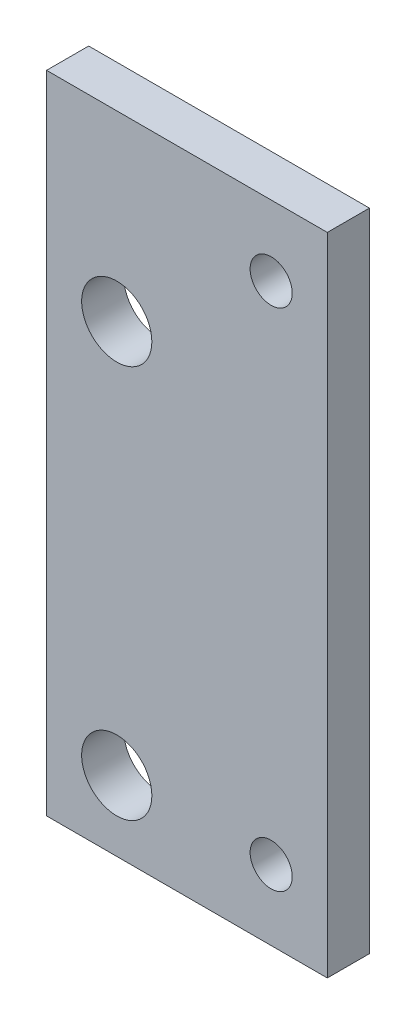
ISO-10303-21;
HEADER;
FILE_DESCRIPTION(('STEP AP214'),'2;1');
FILE_NAME('part.step','',(''),(''),'','','');
FILE_SCHEMA(('AUTOMOTIVE_DESIGN { 1 0 10303 214 1 1 1 1 }'));
ENDSEC;
DATA;
#1=APPLICATION_CONTEXT('core data for automotive mechanical design processes');
#2=APPLICATION_PROTOCOL_DEFINITION('international standard','automotive_design',2000,#1);
#3=PRODUCT_CONTEXT('',#1,'mechanical');
#4=PRODUCT('Part','Part','',(#3));
#5=PRODUCT_RELATED_PRODUCT_CATEGORY('part','',(#4));
#6=PRODUCT_DEFINITION_FORMATION('','',#4);
#7=PRODUCT_DEFINITION_CONTEXT('part definition',#1,'design');
#8=PRODUCT_DEFINITION('design','',#6,#7);
#9=PRODUCT_DEFINITION_SHAPE('','',#8);
#10=(LENGTH_UNIT() NAMED_UNIT(*) SI_UNIT(.MILLI.,.METRE.));
#11=(NAMED_UNIT(*) PLANE_ANGLE_UNIT() SI_UNIT($,.RADIAN.));
#12=(NAMED_UNIT(*) SI_UNIT($,.STERADIAN.) SOLID_ANGLE_UNIT());
#13=UNCERTAINTY_MEASURE_WITH_UNIT(LENGTH_MEASURE(1.E-05),#10,'distance_accuracy_value','');
#14=(GEOMETRIC_REPRESENTATION_CONTEXT(3) GLOBAL_UNCERTAINTY_ASSIGNED_CONTEXT((#13)) GLOBAL_UNIT_ASSIGNED_CONTEXT((#10,
#11,#12)) REPRESENTATION_CONTEXT('',''));
#15=CARTESIAN_POINT('',(0.,0.,0.));
#16=DIRECTION('',(0.,0.,1.));
#17=DIRECTION('',(1.,0.,0.));
#18=AXIS2_PLACEMENT_3D('',#15,#16,#17);
#19=CARTESIAN_POINT('',(0.,46.,3.));
#20=DIRECTION('',(0.,0.,-1.));
#21=DIRECTION('',(-1.,0.,0.));
#22=AXIS2_PLACEMENT_3D('',#19,#20,#21);
#23=PLANE('',#22);
#24=CARTESIAN_POINT('',(16.,41.,3.));
#25=DIRECTION('',(0.,0.,1.));
#26=DIRECTION('',(1.,0.,0.));
#27=AXIS2_PLACEMENT_3D('',#24,#25,#26);
#28=CIRCLE('',#27,1.5);
#29=CARTESIAN_POINT('',(17.5,41.,3.));
#30=VERTEX_POINT('',#29);
#31=EDGE_CURVE('E118',#30,#30,#28,.T.);
#32=ORIENTED_EDGE('',*,*,#31,.F.);
#33=EDGE_LOOP('',(#32));
#34=FACE_BOUND('',#33,.T.);
#35=CARTESIAN_POINT('',(5.,33.,3.));
#36=DIRECTION('',(0.,0.,1.));
#37=DIRECTION('',(1.,0.,0.));
#38=AXIS2_PLACEMENT_3D('',#35,#36,#37);
#39=CIRCLE('',#38,2.5);
#40=CARTESIAN_POINT('',(7.5,33.,3.));
#41=VERTEX_POINT('',#40);
#42=EDGE_CURVE('E97',#41,#41,#39,.T.);
#43=ORIENTED_EDGE('',*,*,#42,.F.);
#44=EDGE_LOOP('',(#43));
#45=FACE_BOUND('',#44,.T.);
#46=DIRECTION('',(0.,-1.,0.));
#47=VECTOR('',#46,1.);
#48=CARTESIAN_POINT('',(0.,0.,3.));
#49=LINE('',#48,#47);
#50=CARTESIAN_POINT('',(0.,46.,3.));
#51=VERTEX_POINT('',#50);
#52=CARTESIAN_POINT('',(0.,0.,3.));
#53=VERTEX_POINT('',#52);
#54=EDGE_CURVE('E82',#51,#53,#49,.T.);
#55=ORIENTED_EDGE('',*,*,#54,.T.);
#56=DIRECTION('',(1.,0.,0.));
#57=VECTOR('',#56,1.);
#58=CARTESIAN_POINT('',(0.,0.,3.));
#59=LINE('',#58,#57);
#60=CARTESIAN_POINT('',(20.,0.,3.));
#61=VERTEX_POINT('',#60);
#62=EDGE_CURVE('E77',#53,#61,#59,.T.);
#63=ORIENTED_EDGE('',*,*,#62,.T.);
#64=DIRECTION('',(0.,1.,0.));
#65=VECTOR('',#64,1.);
#66=CARTESIAN_POINT('',(20.,0.,3.));
#67=LINE('',#66,#65);
#68=CARTESIAN_POINT('',(20.,46.,3.));
#69=VERTEX_POINT('',#68);
#70=EDGE_CURVE('E80',#61,#69,#67,.T.);
#71=ORIENTED_EDGE('',*,*,#70,.T.);
#72=DIRECTION('',(-1.,0.,0.));
#73=VECTOR('',#72,1.);
#74=CARTESIAN_POINT('',(0.,46.,3.));
#75=LINE('',#74,#73);
#76=EDGE_CURVE('E47',#69,#51,#75,.T.);
#77=ORIENTED_EDGE('',*,*,#76,.T.);
#78=EDGE_LOOP('',(#55,#63,#71,#77));
#79=FACE_BOUND('',#78,.T.);
#80=CARTESIAN_POINT('',(5.00000000000001,5.,3.));
#81=DIRECTION('',(0.,0.,1.));
#82=DIRECTION('',(1.,0.,0.));
#83=AXIS2_PLACEMENT_3D('',#80,#81,#82);
#84=CIRCLE('',#83,2.5);
#85=CARTESIAN_POINT('',(7.50000000000001,5.,3.));
#86=VERTEX_POINT('',#85);
#87=EDGE_CURVE('E112',#86,#86,#84,.T.);
#88=ORIENTED_EDGE('',*,*,#87,.F.);
#89=EDGE_LOOP('',(#88));
#90=FACE_BOUND('',#89,.T.);
#91=CARTESIAN_POINT('',(16.,5.,3.));
#92=DIRECTION('',(0.,0.,1.));
#93=DIRECTION('',(-1.,0.,0.));
#94=AXIS2_PLACEMENT_3D('',#91,#92,#93);
#95=CIRCLE('',#94,1.5);
#96=CARTESIAN_POINT('',(14.5,5.,3.));
#97=VERTEX_POINT('',#96);
#98=EDGE_CURVE('E124',#97,#97,#95,.T.);
#99=ORIENTED_EDGE('',*,*,#98,.F.);
#100=EDGE_LOOP('',(#99));
#101=FACE_BOUND('',#100,.T.);
#102=ADVANCED_FACE('F30',(#34,#45,#79,#90,#101),#23,.F.);
#103=CARTESIAN_POINT('',(0.,46.,0.));
#104=DIRECTION('',(0.,0.,-1.));
#105=DIRECTION('',(-1.,0.,0.));
#106=AXIS2_PLACEMENT_3D('',#103,#104,#105);
#107=PLANE('',#106);
#108=CARTESIAN_POINT('',(16.,41.,0.));
#109=DIRECTION('',(0.,0.,1.));
#110=DIRECTION('',(1.,0.,0.));
#111=AXIS2_PLACEMENT_3D('',#108,#109,#110);
#112=CIRCLE('',#111,1.5);
#113=CARTESIAN_POINT('',(17.5,41.,0.));
#114=VERTEX_POINT('',#113);
#115=EDGE_CURVE('E121',#114,#114,#112,.T.);
#116=ORIENTED_EDGE('',*,*,#115,.T.);
#117=EDGE_LOOP('',(#116));
#118=FACE_BOUND('',#117,.T.);
#119=CARTESIAN_POINT('',(5.,33.,0.));
#120=DIRECTION('',(0.,0.,1.));
#121=DIRECTION('',(1.,0.,0.));
#122=AXIS2_PLACEMENT_3D('',#119,#120,#121);
#123=CIRCLE('',#122,2.5);
#124=CARTESIAN_POINT('',(7.5,33.,0.));
#125=VERTEX_POINT('',#124);
#126=EDGE_CURVE('E109',#125,#125,#123,.T.);
#127=ORIENTED_EDGE('',*,*,#126,.T.);
#128=EDGE_LOOP('',(#127));
#129=FACE_BOUND('',#128,.T.);
#130=DIRECTION('',(0.,-1.,0.));
#131=VECTOR('',#130,1.);
#132=CARTESIAN_POINT('',(0.,0.,0.));
#133=LINE('',#132,#131);
#134=CARTESIAN_POINT('',(0.,46.,0.));
#135=VERTEX_POINT('',#134);
#136=CARTESIAN_POINT('',(0.,0.,0.));
#137=VERTEX_POINT('',#136);
#138=EDGE_CURVE('E94',#135,#137,#133,.T.);
#139=ORIENTED_EDGE('',*,*,#138,.F.);
#140=DIRECTION('',(-1.,0.,0.));
#141=VECTOR('',#140,1.);
#142=CARTESIAN_POINT('',(0.,46.,0.));
#143=LINE('',#142,#141);
#144=CARTESIAN_POINT('',(20.,46.,0.));
#145=VERTEX_POINT('',#144);
#146=EDGE_CURVE('E70',#145,#135,#143,.T.);
#147=ORIENTED_EDGE('',*,*,#146,.F.);
#148=DIRECTION('',(0.,1.,0.));
#149=VECTOR('',#148,1.);
#150=CARTESIAN_POINT('',(20.,0.,0.));
#151=LINE('',#150,#149);
#152=CARTESIAN_POINT('',(20.,0.,0.));
#153=VERTEX_POINT('',#152);
#154=EDGE_CURVE('E64',#153,#145,#151,.T.);
#155=ORIENTED_EDGE('',*,*,#154,.F.);
#156=DIRECTION('',(1.,0.,0.));
#157=VECTOR('',#156,1.);
#158=CARTESIAN_POINT('',(0.,0.,0.));
#159=LINE('',#158,#157);
#160=EDGE_CURVE('E86',#137,#153,#159,.T.);
#161=ORIENTED_EDGE('',*,*,#160,.F.);
#162=EDGE_LOOP('',(#139,#147,#155,#161));
#163=FACE_BOUND('',#162,.T.);
#164=CARTESIAN_POINT('',(5.00000000000001,5.,0.));
#165=DIRECTION('',(0.,0.,1.));
#166=DIRECTION('',(1.,0.,0.));
#167=AXIS2_PLACEMENT_3D('',#164,#165,#166);
#168=CIRCLE('',#167,2.5);
#169=CARTESIAN_POINT('',(7.50000000000001,5.,0.));
#170=VERTEX_POINT('',#169);
#171=EDGE_CURVE('E115',#170,#170,#168,.T.);
#172=ORIENTED_EDGE('',*,*,#171,.T.);
#173=EDGE_LOOP('',(#172));
#174=FACE_BOUND('',#173,.T.);
#175=CARTESIAN_POINT('',(16.,5.,0.));
#176=DIRECTION('',(0.,0.,1.));
#177=DIRECTION('',(-1.,0.,0.));
#178=AXIS2_PLACEMENT_3D('',#175,#176,#177);
#179=CIRCLE('',#178,1.5);
#180=CARTESIAN_POINT('',(14.5,5.,0.));
#181=VERTEX_POINT('',#180);
#182=EDGE_CURVE('E127',#181,#181,#179,.T.);
#183=ORIENTED_EDGE('',*,*,#182,.T.);
#184=EDGE_LOOP('',(#183));
#185=FACE_BOUND('',#184,.T.);
#186=ADVANCED_FACE('F105',(#118,#129,#163,#174,#185),#107,.T.);
#187=CARTESIAN_POINT('',(0.,0.,3.));
#188=DIRECTION('',(1.,0.,0.));
#189=DIRECTION('',(0.,0.,-1.));
#190=AXIS2_PLACEMENT_3D('',#187,#188,#189);
#191=PLANE('',#190);
#192=ORIENTED_EDGE('',*,*,#138,.T.);
#193=DIRECTION('',(0.,0.,-1.));
#194=VECTOR('',#193,1.);
#195=CARTESIAN_POINT('',(0.,0.,3.));
#196=LINE('',#195,#194);
#197=EDGE_CURVE('E11',#53,#137,#196,.T.);
#198=ORIENTED_EDGE('',*,*,#197,.F.);
#199=ORIENTED_EDGE('',*,*,#54,.F.);
#200=DIRECTION('',(0.,0.,-1.));
#201=VECTOR('',#200,1.);
#202=CARTESIAN_POINT('',(0.,46.,3.));
#203=LINE('',#202,#201);
#204=EDGE_CURVE('E90',#51,#135,#203,.T.);
#205=ORIENTED_EDGE('',*,*,#204,.T.);
#206=EDGE_LOOP('',(#192,#198,#199,#205));
#207=FACE_BOUND('',#206,.T.);
#208=ADVANCED_FACE('F32',(#207),#191,.F.);
#209=CARTESIAN_POINT('',(0.,0.,3.));
#210=DIRECTION('',(0.,1.,0.));
#211=DIRECTION('',(0.,0.,1.));
#212=AXIS2_PLACEMENT_3D('',#209,#210,#211);
#213=PLANE('',#212);
#214=ORIENTED_EDGE('',*,*,#160,.T.);
#215=DIRECTION('',(0.,0.,-1.));
#216=VECTOR('',#215,1.);
#217=CARTESIAN_POINT('',(20.,0.,3.));
#218=LINE('',#217,#216);
#219=EDGE_CURVE('E39',#61,#153,#218,.T.);
#220=ORIENTED_EDGE('',*,*,#219,.F.);
#221=ORIENTED_EDGE('',*,*,#62,.F.);
#222=ORIENTED_EDGE('',*,*,#197,.T.);
#223=EDGE_LOOP('',(#214,#220,#221,#222));
#224=FACE_BOUND('',#223,.T.);
#225=ADVANCED_FACE('F85',(#224),#213,.F.);
#226=CARTESIAN_POINT('',(20.,0.,3.));
#227=DIRECTION('',(-1.,0.,0.));
#228=DIRECTION('',(0.,0.,1.));
#229=AXIS2_PLACEMENT_3D('',#226,#227,#228);
#230=PLANE('',#229);
#231=ORIENTED_EDGE('',*,*,#154,.T.);
#232=DIRECTION('',(0.,0.,-1.));
#233=VECTOR('',#232,1.);
#234=CARTESIAN_POINT('',(20.,46.,3.));
#235=LINE('',#234,#233);
#236=EDGE_CURVE('E87',#69,#145,#235,.T.);
#237=ORIENTED_EDGE('',*,*,#236,.F.);
#238=ORIENTED_EDGE('',*,*,#70,.F.);
#239=ORIENTED_EDGE('',*,*,#219,.T.);
#240=EDGE_LOOP('',(#231,#237,#238,#239));
#241=FACE_BOUND('',#240,.T.);
#242=ADVANCED_FACE('F88',(#241),#230,.F.);
#243=CARTESIAN_POINT('',(0.,46.,3.));
#244=DIRECTION('',(0.,-1.,0.));
#245=DIRECTION('',(0.,0.,-1.));
#246=AXIS2_PLACEMENT_3D('',#243,#244,#245);
#247=PLANE('',#246);
#248=ORIENTED_EDGE('',*,*,#146,.T.);
#249=ORIENTED_EDGE('',*,*,#204,.F.);
#250=ORIENTED_EDGE('',*,*,#76,.F.);
#251=ORIENTED_EDGE('',*,*,#236,.T.);
#252=EDGE_LOOP('',(#248,#249,#250,#251));
#253=FACE_BOUND('',#252,.T.);
#254=ADVANCED_FACE('F102',(#253),#247,.F.);
#255=CARTESIAN_POINT('',(5.,33.,3.));
#256=DIRECTION('',(0.,0.,-1.));
#257=DIRECTION('',(-1.,0.,0.));
#258=AXIS2_PLACEMENT_3D('',#255,#256,#257);
#259=CYLINDRICAL_SURFACE('',#258,2.5);
#260=ORIENTED_EDGE('',*,*,#42,.T.);
#261=EDGE_LOOP('',(#260));
#262=FACE_BOUND('',#261,.T.);
#263=ORIENTED_EDGE('',*,*,#126,.F.);
#264=EDGE_LOOP('',(#263));
#265=FACE_BOUND('',#264,.T.);
#266=ADVANCED_FACE('F147',(#262,#265),#259,.F.);
#267=CARTESIAN_POINT('',(5.00000000000001,5.,3.));
#268=DIRECTION('',(0.,0.,-1.));
#269=DIRECTION('',(-1.,0.,0.));
#270=AXIS2_PLACEMENT_3D('',#267,#268,#269);
#271=CYLINDRICAL_SURFACE('',#270,2.5);
#272=ORIENTED_EDGE('',*,*,#87,.T.);
#273=EDGE_LOOP('',(#272));
#274=FACE_BOUND('',#273,.T.);
#275=ORIENTED_EDGE('',*,*,#171,.F.);
#276=EDGE_LOOP('',(#275));
#277=FACE_BOUND('',#276,.T.);
#278=ADVANCED_FACE('F193',(#274,#277),#271,.F.);
#279=CARTESIAN_POINT('',(16.,41.,3.));
#280=DIRECTION('',(0.,0.,-1.));
#281=DIRECTION('',(-1.,0.,0.));
#282=AXIS2_PLACEMENT_3D('',#279,#280,#281);
#283=CYLINDRICAL_SURFACE('',#282,1.5);
#284=ORIENTED_EDGE('',*,*,#31,.T.);
#285=EDGE_LOOP('',(#284));
#286=FACE_BOUND('',#285,.T.);
#287=ORIENTED_EDGE('',*,*,#115,.F.);
#288=EDGE_LOOP('',(#287));
#289=FACE_BOUND('',#288,.T.);
#290=ADVANCED_FACE('F201',(#286,#289),#283,.F.);
#291=CARTESIAN_POINT('',(16.,5.,3.));
#292=DIRECTION('',(0.,0.,-1.));
#293=DIRECTION('',(-1.,0.,0.));
#294=AXIS2_PLACEMENT_3D('',#291,#292,#293);
#295=CYLINDRICAL_SURFACE('',#294,1.5);
#296=ORIENTED_EDGE('',*,*,#98,.T.);
#297=EDGE_LOOP('',(#296));
#298=FACE_BOUND('',#297,.T.);
#299=ORIENTED_EDGE('',*,*,#182,.F.);
#300=EDGE_LOOP('',(#299));
#301=FACE_BOUND('',#300,.T.);
#302=ADVANCED_FACE('F133',(#298,#301),#295,.F.);
#303=CLOSED_SHELL('',(#102,#186,#208,#225,#242,#254,#266,#278,#290,#302));
#304=MANIFOLD_SOLID_BREP('B2',#303);
#305=ADVANCED_BREP_SHAPE_REPRESENTATION('',(#18,#304),#14);
#306=SHAPE_DEFINITION_REPRESENTATION(#9,#305);
ENDSEC;
END-ISO-10303-21;
